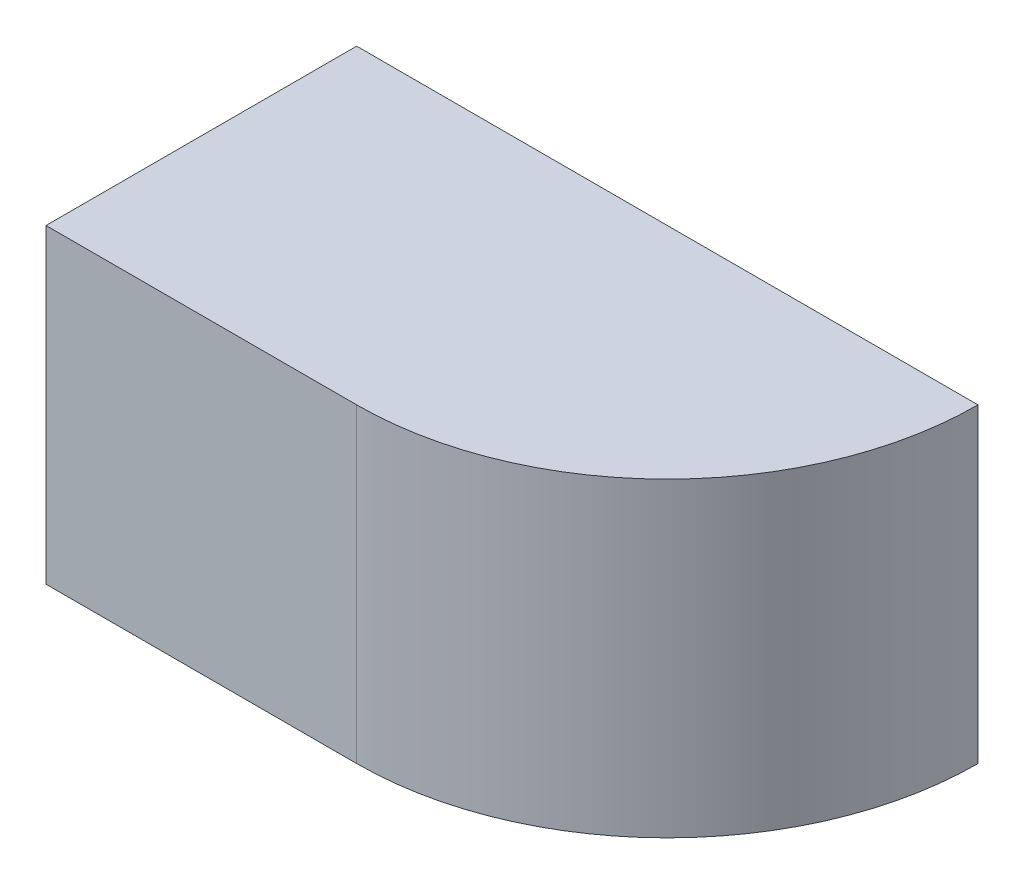
ISO-10303-21;
HEADER;
FILE_DESCRIPTION(('STEP AP214'),'2;1');
FILE_NAME('part.step','',(''),(''),'','','');
FILE_SCHEMA(('AUTOMOTIVE_DESIGN { 1 0 10303 214 1 1 1 1 }'));
ENDSEC;
DATA;
#1=APPLICATION_CONTEXT('core data for automotive mechanical design processes');
#2=APPLICATION_PROTOCOL_DEFINITION('international standard','automotive_design',2000,#1);
#3=PRODUCT_CONTEXT('',#1,'mechanical');
#4=PRODUCT('Part','Part','',(#3));
#5=PRODUCT_RELATED_PRODUCT_CATEGORY('part','',(#4));
#6=PRODUCT_DEFINITION_FORMATION('','',#4);
#7=PRODUCT_DEFINITION_CONTEXT('part definition',#1,'design');
#8=PRODUCT_DEFINITION('design','',#6,#7);
#9=PRODUCT_DEFINITION_SHAPE('','',#8);
#10=(LENGTH_UNIT() NAMED_UNIT(*) SI_UNIT(.MILLI.,.METRE.));
#11=(NAMED_UNIT(*) PLANE_ANGLE_UNIT() SI_UNIT($,.RADIAN.));
#12=(NAMED_UNIT(*) SI_UNIT($,.STERADIAN.) SOLID_ANGLE_UNIT());
#13=UNCERTAINTY_MEASURE_WITH_UNIT(LENGTH_MEASURE(1.E-05),#10,'distance_accuracy_value','');
#14=(GEOMETRIC_REPRESENTATION_CONTEXT(3) GLOBAL_UNCERTAINTY_ASSIGNED_CONTEXT((#13)) GLOBAL_UNIT_ASSIGNED_CONTEXT((#10,
#11,#12)) REPRESENTATION_CONTEXT('',''));
#15=CARTESIAN_POINT('',(0.,0.,0.));
#16=DIRECTION('',(0.,0.,1.));
#17=DIRECTION('',(1.,0.,0.));
#18=AXIS2_PLACEMENT_3D('',#15,#16,#17);
#19=CARTESIAN_POINT('',(2.00000002980232,-5.75000013038516,2.));
#20=DIRECTION('',(0.,0.,1.));
#21=DIRECTION('',(1.,0.,0.));
#22=AXIS2_PLACEMENT_3D('',#19,#20,#21);
#23=PLANE('',#22);
#24=DIRECTION('',(0.,-1.,0.));
#25=VECTOR('',#24,1.);
#26=CARTESIAN_POINT('',(1.50000002235174,-5.50000012665987,2.));
#27=LINE('',#26,#25);
#28=CARTESIAN_POINT('',(1.50000002235174,-5.50000012665987,2.));
#29=VERTEX_POINT('',#28);
#30=CARTESIAN_POINT('',(1.50000002235174,-6.00000013411045,2.));
#31=VERTEX_POINT('',#30);
#32=EDGE_CURVE('E11',#29,#31,#27,.T.);
#33=ORIENTED_EDGE('',*,*,#32,.F.);
#34=DIRECTION('',(-1.,0.,0.));
#35=VECTOR('',#34,1.);
#36=CARTESIAN_POINT('',(2.5000000372529,-5.50000012665987,2.));
#37=LINE('',#36,#35);
#38=CARTESIAN_POINT('',(2.5000000372529,-5.50000012665987,2.));
#39=VERTEX_POINT('',#38);
#40=EDGE_CURVE('E108',#39,#29,#37,.T.);
#41=ORIENTED_EDGE('',*,*,#40,.F.);
#42=DIRECTION('',(0.,1.,0.));
#43=VECTOR('',#42,1.);
#44=CARTESIAN_POINT('',(2.5000000372529,-6.00000013411045,2.));
#45=LINE('',#44,#43);
#46=CARTESIAN_POINT('',(2.5000000372529,-6.00000013411045,2.));
#47=VERTEX_POINT('',#46);
#48=EDGE_CURVE('E79',#47,#39,#45,.T.);
#49=ORIENTED_EDGE('',*,*,#48,.F.);
#50=DIRECTION('',(1.,0.,0.));
#51=VECTOR('',#50,1.);
#52=CARTESIAN_POINT('',(1.50000002235174,-6.00000013411045,2.));
#53=LINE('',#52,#51);
#54=EDGE_CURVE('E28',#31,#47,#53,.T.);
#55=ORIENTED_EDGE('',*,*,#54,.F.);
#56=EDGE_LOOP('',(#33,#41,#49,#55));
#57=FACE_BOUND('',#56,.T.);
#58=ADVANCED_FACE('F17',(#57),#23,.F.);
#59=CARTESIAN_POINT('',(1.50000002235174,-5.50000012665987,2.));
#60=DIRECTION('',(-1.,0.,0.));
#61=DIRECTION('',(0.,0.,1.));
#62=AXIS2_PLACEMENT_3D('',#59,#60,#61);
#63=PLANE('',#62);
#64=ORIENTED_EDGE('',*,*,#32,.T.);
#65=DIRECTION('',(0.,0.,1.));
#66=VECTOR('',#65,1.);
#67=CARTESIAN_POINT('',(1.50000002235174,-6.00000013411045,2.));
#68=LINE('',#67,#66);
#69=CARTESIAN_POINT('',(1.50000002235174,-6.00000013411045,2.5));
#70=VERTEX_POINT('',#69);
#71=EDGE_CURVE('E107',#31,#70,#68,.T.);
#72=ORIENTED_EDGE('',*,*,#71,.T.);
#73=DIRECTION('',(0.,-1.,0.));
#74=VECTOR('',#73,1.);
#75=CARTESIAN_POINT('',(1.50000002235174,-5.50000012665987,2.5));
#76=LINE('',#75,#74);
#77=CARTESIAN_POINT('',(1.50000002235174,-5.50000012665987,2.5));
#78=VERTEX_POINT('',#77);
#79=EDGE_CURVE('E78',#78,#70,#76,.T.);
#80=ORIENTED_EDGE('',*,*,#79,.F.);
#81=DIRECTION('',(0.,0.,1.));
#82=VECTOR('',#81,1.);
#83=CARTESIAN_POINT('',(1.50000002235174,-5.50000012665987,2.));
#84=LINE('',#83,#82);
#85=EDGE_CURVE('E73',#29,#78,#84,.T.);
#86=ORIENTED_EDGE('',*,*,#85,.F.);
#87=EDGE_LOOP('',(#64,#72,#80,#86));
#88=FACE_BOUND('',#87,.T.);
#89=ADVANCED_FACE('F117',(#88),#63,.T.);
#90=CARTESIAN_POINT('',(1.50000002235174,-6.00000013411045,2.));
#91=DIRECTION('',(0.,-1.,0.));
#92=DIRECTION('',(0.,0.,-1.));
#93=AXIS2_PLACEMENT_3D('',#90,#91,#92);
#94=PLANE('',#93);
#95=CARTESIAN_POINT('',(2.0000000372529,-6.00000013411045,2.));
#96=DIRECTION('',(0.,1.,0.));
#97=DIRECTION('',(0.707106781186548,0.,0.707106781186548));
#98=AXIS2_PLACEMENT_3D('',#95,#96,#97);
#99=CIRCLE('',#98,0.5);
#100=CARTESIAN_POINT('',(2.0000000372529,-6.00000013411045,2.5));
#101=VERTEX_POINT('',#100);
#102=EDGE_CURVE('E89',#101,#47,#99,.T.);
#103=ORIENTED_EDGE('',*,*,#102,.F.);
#104=DIRECTION('',(1.,0.,0.));
#105=VECTOR('',#104,1.);
#106=CARTESIAN_POINT('',(1.50000002235174,-6.00000013411045,2.5));
#107=LINE('',#106,#105);
#108=EDGE_CURVE('E21',#70,#101,#107,.T.);
#109=ORIENTED_EDGE('',*,*,#108,.F.);
#110=ORIENTED_EDGE('',*,*,#71,.F.);
#111=ORIENTED_EDGE('',*,*,#54,.T.);
#112=EDGE_LOOP('',(#103,#109,#110,#111));
#113=FACE_BOUND('',#112,.T.);
#114=ADVANCED_FACE('F157',(#113),#94,.T.);
#115=CARTESIAN_POINT('',(2.5000000372529,-5.50000012665987,2.));
#116=DIRECTION('',(0.,1.,0.));
#117=DIRECTION('',(1.,0.,0.));
#118=AXIS2_PLACEMENT_3D('',#115,#116,#117);
#119=PLANE('',#118);
#120=CARTESIAN_POINT('',(2.0000000372529,-5.50000012665987,2.));
#121=DIRECTION('',(0.,-1.,0.));
#122=DIRECTION('',(0.707106781186548,0.,0.707106781186548));
#123=AXIS2_PLACEMENT_3D('',#120,#121,#122);
#124=CIRCLE('',#123,0.5);
#125=CARTESIAN_POINT('',(2.0000000372529,-5.50000012665987,2.5));
#126=VERTEX_POINT('',#125);
#127=EDGE_CURVE('E72',#39,#126,#124,.T.);
#128=ORIENTED_EDGE('',*,*,#127,.F.);
#129=ORIENTED_EDGE('',*,*,#40,.T.);
#130=ORIENTED_EDGE('',*,*,#85,.T.);
#131=DIRECTION('',(-1.,0.,0.));
#132=VECTOR('',#131,1.);
#133=CARTESIAN_POINT('',(2.5000000372529,-5.50000012665987,2.5));
#134=LINE('',#133,#132);
#135=EDGE_CURVE('E67',#126,#78,#134,.T.);
#136=ORIENTED_EDGE('',*,*,#135,.F.);
#137=EDGE_LOOP('',(#128,#129,#130,#136));
#138=FACE_BOUND('',#137,.T.);
#139=ADVANCED_FACE('F69',(#138),#119,.T.);
#140=CARTESIAN_POINT('',(2.00000002980232,-5.75000013038516,2.5));
#141=DIRECTION('',(0.,0.,1.));
#142=DIRECTION('',(1.,0.,0.));
#143=AXIS2_PLACEMENT_3D('',#140,#141,#142);
#144=PLANE('',#143);
#145=DIRECTION('',(0.,-1.,0.));
#146=VECTOR('',#145,1.);
#147=CARTESIAN_POINT('',(2.0000000372529,-5.87500013224781,2.5));
#148=LINE('',#147,#146);
#149=EDGE_CURVE('E82',#126,#101,#148,.T.);
#150=ORIENTED_EDGE('',*,*,#149,.F.);
#151=ORIENTED_EDGE('',*,*,#135,.T.);
#152=ORIENTED_EDGE('',*,*,#79,.T.);
#153=ORIENTED_EDGE('',*,*,#108,.T.);
#154=EDGE_LOOP('',(#150,#151,#152,#153));
#155=FACE_BOUND('',#154,.T.);
#156=ADVANCED_FACE('F83',(#155),#144,.T.);
#157=CARTESIAN_POINT('',(2.0000000372529,-5.87500013224781,2.));
#158=DIRECTION('',(0.,1.,0.));
#159=DIRECTION('',(0.707106781186548,0.,0.707106781186548));
#160=AXIS2_PLACEMENT_3D('',#157,#158,#159);
#161=CYLINDRICAL_SURFACE('',#160,0.5);
#162=ORIENTED_EDGE('',*,*,#127,.T.);
#163=ORIENTED_EDGE('',*,*,#149,.T.);
#164=ORIENTED_EDGE('',*,*,#102,.T.);
#165=ORIENTED_EDGE('',*,*,#48,.T.);
#166=EDGE_LOOP('',(#162,#163,#164,#165));
#167=FACE_BOUND('',#166,.T.);
#168=ADVANCED_FACE('F19',(#167),#161,.T.);
#169=CLOSED_SHELL('',(#58,#89,#114,#139,#156,#168));
#170=MANIFOLD_SOLID_BREP('B1',#169);
#171=ADVANCED_BREP_SHAPE_REPRESENTATION('',(#18,#170),#14);
#172=SHAPE_DEFINITION_REPRESENTATION(#9,#171);
ENDSEC;
END-ISO-10303-21;
